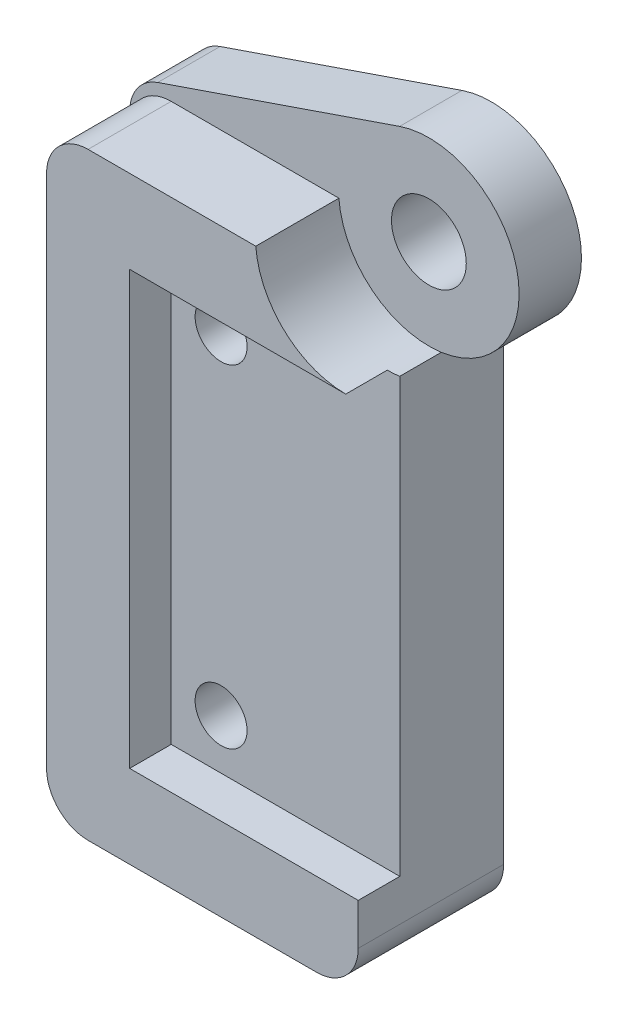
ISO-10303-21;
HEADER;
FILE_DESCRIPTION(('STEP AP214'),'2;1');
FILE_NAME('part.step','',(''),(''),'','','');
FILE_SCHEMA(('AUTOMOTIVE_DESIGN { 1 0 10303 214 1 1 1 1 }'));
ENDSEC;
DATA;
#1=APPLICATION_CONTEXT('core data for automotive mechanical design processes');
#2=APPLICATION_PROTOCOL_DEFINITION('international standard','automotive_design',2000,#1);
#3=PRODUCT_CONTEXT('',#1,'mechanical');
#4=PRODUCT('Part','Part','',(#3));
#5=PRODUCT_RELATED_PRODUCT_CATEGORY('part','',(#4));
#6=PRODUCT_DEFINITION_FORMATION('','',#4);
#7=PRODUCT_DEFINITION_CONTEXT('part definition',#1,'design');
#8=PRODUCT_DEFINITION('design','',#6,#7);
#9=PRODUCT_DEFINITION_SHAPE('','',#8);
#10=(LENGTH_UNIT() NAMED_UNIT(*) SI_UNIT(.MILLI.,.METRE.));
#11=(NAMED_UNIT(*) PLANE_ANGLE_UNIT() SI_UNIT($,.RADIAN.));
#12=(NAMED_UNIT(*) SI_UNIT($,.STERADIAN.) SOLID_ANGLE_UNIT());
#13=UNCERTAINTY_MEASURE_WITH_UNIT(LENGTH_MEASURE(1.E-05),#10,'distance_accuracy_value','');
#14=(GEOMETRIC_REPRESENTATION_CONTEXT(3) GLOBAL_UNCERTAINTY_ASSIGNED_CONTEXT((#13)) GLOBAL_UNIT_ASSIGNED_CONTEXT((#10,
#11,#12)) REPRESENTATION_CONTEXT('',''));
#15=CARTESIAN_POINT('',(0.,0.,0.));
#16=DIRECTION('',(0.,0.,1.));
#17=DIRECTION('',(1.,0.,0.));
#18=AXIS2_PLACEMENT_3D('',#15,#16,#17);
#19=CARTESIAN_POINT('',(0.,0.,3.));
#20=DIRECTION('',(0.,0.,1.));
#21=DIRECTION('',(1.,0.,0.));
#22=AXIS2_PLACEMENT_3D('',#19,#20,#21);
#23=PLANE('',#22);
#24=CARTESIAN_POINT('',(-30.,14.7437,3.));
#25=DIRECTION('',(0.,0.,1.));
#26=DIRECTION('',(1.,0.,0.));
#27=AXIS2_PLACEMENT_3D('',#24,#25,#26);
#28=CIRCLE('',#27,1.8);
#29=CARTESIAN_POINT('',(-28.2,14.7437,3.));
#30=VERTEX_POINT('',#29);
#31=EDGE_CURVE('E259',#30,#30,#28,.T.);
#32=ORIENTED_EDGE('',*,*,#31,.F.);
#33=EDGE_LOOP('',(#32));
#34=FACE_BOUND('',#33,.T.);
#35=DIRECTION('',(0.945980151781312,0.324224540150504,0.));
#36=VECTOR('',#35,1.);
#37=CARTESIAN_POINT('',(-9.08402063587007,26.5041727437287,3.));
#38=LINE('',#37,#36);
#39=CARTESIAN_POINT('',(-43.048449080301,14.8632295662908,3.));
#40=VERTEX_POINT('',#39);
#41=CARTESIAN_POINT('',(-31.4083341350517,18.8527539852925,3.));
#42=VERTEX_POINT('',#41);
#43=EDGE_CURVE('E256',#40,#42,#38,.T.);
#44=ORIENTED_EDGE('',*,*,#43,.F.);
#45=CARTESIAN_POINT('',(-42.4,12.9712692627282,3.));
#46=DIRECTION('',(0.,0.,1.));
#47=DIRECTION('',(1.,0.,0.));
#48=AXIS2_PLACEMENT_3D('',#45,#46,#47);
#49=CIRCLE('',#48,2.);
#50=CARTESIAN_POINT('',(-44.4,12.9712692627282,3.));
#51=VERTEX_POINT('',#50);
#52=EDGE_CURVE('E12',#40,#51,#49,.T.);
#53=ORIENTED_EDGE('',*,*,#52,.T.);
#54=DIRECTION('',(0.,1.,0.));
#55=VECTOR('',#54,1.);
#56=CARTESIAN_POINT('',(-44.4,0.,3.));
#57=LINE('',#56,#55);
#58=CARTESIAN_POINT('',(-44.4,12.4,3.));
#59=VERTEX_POINT('',#58);
#60=EDGE_CURVE('E289',#59,#51,#57,.T.);
#61=ORIENTED_EDGE('',*,*,#60,.F.);
#62=CARTESIAN_POINT('',(-42.4,12.4,3.));
#63=DIRECTION('',(0.,0.,1.));
#64=DIRECTION('',(1.,0.,0.));
#65=AXIS2_PLACEMENT_3D('',#62,#63,#64);
#66=CIRCLE('',#65,2.);
#67=CARTESIAN_POINT('',(-42.4,14.4,3.));
#68=VERTEX_POINT('',#67);
#69=EDGE_CURVE('E315',#59,#68,#66,.F.);
#70=ORIENTED_EDGE('',*,*,#69,.T.);
#71=DIRECTION('',(-1.,0.,0.));
#72=VECTOR('',#71,1.);
#73=CARTESIAN_POINT('',(0.,14.4,3.));
#74=LINE('',#73,#72);
#75=CARTESIAN_POINT('',(-34.3300808306543,14.4,3.));
#76=VERTEX_POINT('',#75);
#77=EDGE_CURVE('E235',#76,#68,#74,.T.);
#78=ORIENTED_EDGE('',*,*,#77,.F.);
#79=CARTESIAN_POINT('',(-30.,14.7437,3.));
#80=DIRECTION('',(0.,0.,1.));
#81=DIRECTION('',(1.,0.,0.));
#82=AXIS2_PLACEMENT_3D('',#79,#80,#81);
#83=CIRCLE('',#82,4.34370000000001);
#84=CARTESIAN_POINT('',(-29.4,10.4416389021075,3.));
#85=VERTEX_POINT('',#84);
#86=EDGE_CURVE('E228',#76,#85,#83,.T.);
#87=ORIENTED_EDGE('',*,*,#86,.T.);
#88=CARTESIAN_POINT('',(-30.,14.7437,3.));
#89=DIRECTION('',(0.,0.,1.));
#90=DIRECTION('',(1.,0.,0.));
#91=AXIS2_PLACEMENT_3D('',#88,#89,#90);
#92=CIRCLE('',#91,4.34370000000001);
#93=EDGE_CURVE('E253',#85,#42,#92,.T.);
#94=ORIENTED_EDGE('',*,*,#93,.T.);
#95=EDGE_LOOP('',(#44,#53,#61,#70,#78,#87,#94));
#96=FACE_BOUND('',#95,.T.);
#97=ADVANCED_FACE('F79',(#34,#96),#23,.T.);
#98=CARTESIAN_POINT('',(-29.4,0.,3.));
#99=DIRECTION('',(1.,0.,0.));
#100=DIRECTION('',(0.,1.,0.));
#101=AXIS2_PLACEMENT_3D('',#98,#99,#100);
#102=PLANE('',#101);
#103=DIRECTION('',(0.,1.,0.));
#104=VECTOR('',#103,1.);
#105=CARTESIAN_POINT('',(-29.4,14.7437,7.));
#106=LINE('',#105,#104);
#107=CARTESIAN_POINT('',(-29.4,-12.4,7.));
#108=VERTEX_POINT('',#107);
#109=CARTESIAN_POINT('',(-29.4,-10.4,7.));
#110=VERTEX_POINT('',#109);
#111=EDGE_CURVE('E205',#108,#110,#106,.T.);
#112=ORIENTED_EDGE('',*,*,#111,.F.);
#113=DIRECTION('',(0.,0.,-1.));
#114=VECTOR('',#113,1.);
#115=CARTESIAN_POINT('',(-29.4,-12.4,3.));
#116=LINE('',#115,#114);
#117=CARTESIAN_POINT('',(-29.4,-12.4,0.));
#118=VERTEX_POINT('',#117);
#119=EDGE_CURVE('E303',#108,#118,#116,.T.);
#120=ORIENTED_EDGE('',*,*,#119,.T.);
#121=DIRECTION('',(0.,-1.,0.));
#122=VECTOR('',#121,1.);
#123=CARTESIAN_POINT('',(-29.4,0.,0.));
#124=LINE('',#123,#122);
#125=CARTESIAN_POINT('',(-29.4,10.4416389021075,0.));
#126=VERTEX_POINT('',#125);
#127=EDGE_CURVE('E268',#126,#118,#124,.T.);
#128=ORIENTED_EDGE('',*,*,#127,.F.);
#129=DIRECTION('',(0.,0.,-1.));
#130=VECTOR('',#129,1.);
#131=CARTESIAN_POINT('',(-29.4,10.4416389021075,3.));
#132=LINE('',#131,#130);
#133=EDGE_CURVE('E285',#85,#126,#132,.T.);
#134=ORIENTED_EDGE('',*,*,#133,.F.);
#135=DIRECTION('',(0.,0.,-1.));
#136=VECTOR('',#135,1.);
#137=CARTESIAN_POINT('',(-29.4,10.4416389021075,5.));
#138=LINE('',#137,#136);
#139=CARTESIAN_POINT('',(-29.4,10.4416389021075,5.));
#140=VERTEX_POINT('',#139);
#141=EDGE_CURVE('E237',#140,#85,#138,.T.);
#142=ORIENTED_EDGE('',*,*,#141,.F.);
#143=DIRECTION('',(0.,1.,0.));
#144=VECTOR('',#143,1.);
#145=CARTESIAN_POINT('',(-29.4,0.,5.));
#146=LINE('',#145,#144);
#147=CARTESIAN_POINT('',(-29.4,-10.4,5.));
#148=VERTEX_POINT('',#147);
#149=EDGE_CURVE('E234',#148,#140,#146,.T.);
#150=ORIENTED_EDGE('',*,*,#149,.F.);
#151=DIRECTION('',(0.,0.,-1.));
#152=VECTOR('',#151,1.);
#153=CARTESIAN_POINT('',(-29.4,-10.4,7.));
#154=LINE('',#153,#152);
#155=EDGE_CURVE('E344',#110,#148,#154,.T.);
#156=ORIENTED_EDGE('',*,*,#155,.F.);
#157=EDGE_LOOP('',(#112,#120,#128,#134,#142,#150,#156));
#158=FACE_BOUND('',#157,.T.);
#159=ADVANCED_FACE('F372',(#158),#102,.T.);
#160=CARTESIAN_POINT('',(-30.,14.7437,3.));
#161=DIRECTION('',(0.,0.,-1.));
#162=DIRECTION('',(-1.,0.,0.));
#163=AXIS2_PLACEMENT_3D('',#160,#161,#162);
#164=CYLINDRICAL_SURFACE('',#163,4.34370000000001);
#165=CARTESIAN_POINT('',(-30.,14.7437,0.));
#166=DIRECTION('',(0.,0.,1.));
#167=DIRECTION('',(1.,0.,0.));
#168=AXIS2_PLACEMENT_3D('',#165,#166,#167);
#169=CIRCLE('',#168,4.34370000000001);
#170=CARTESIAN_POINT('',(-31.4083341350517,18.8527539852925,0.));
#171=VERTEX_POINT('',#170);
#172=EDGE_CURVE('E271',#126,#171,#169,.T.);
#173=ORIENTED_EDGE('',*,*,#172,.T.);
#174=DIRECTION('',(0.,0.,-1.));
#175=VECTOR('',#174,1.);
#176=CARTESIAN_POINT('',(-31.4083341350517,18.8527539852925,3.));
#177=LINE('',#176,#175);
#178=EDGE_CURVE('E262',#42,#171,#177,.T.);
#179=ORIENTED_EDGE('',*,*,#178,.F.);
#180=ORIENTED_EDGE('',*,*,#93,.F.);
#181=ORIENTED_EDGE('',*,*,#133,.T.);
#182=EDGE_LOOP('',(#173,#179,#180,#181));
#183=FACE_BOUND('',#182,.T.);
#184=ADVANCED_FACE('F402',(#183),#164,.T.);
#185=CARTESIAN_POINT('',(-9.08402063587007,26.5041727437287,3.));
#186=DIRECTION('',(-0.324224540150504,0.945980151781312,0.));
#187=DIRECTION('',(-0.945980151781312,-0.324224540150504,0.));
#188=AXIS2_PLACEMENT_3D('',#185,#186,#187);
#189=PLANE('',#188);
#190=DIRECTION('',(0.945980151781312,0.324224540150504,0.));
#191=VECTOR('',#190,1.);
#192=CARTESIAN_POINT('',(-9.08402063587007,26.5041727437287,0.));
#193=LINE('',#192,#191);
#194=CARTESIAN_POINT('',(-43.048449080301,14.8632295662908,0.));
#195=VERTEX_POINT('',#194);
#196=EDGE_CURVE('E274',#195,#171,#193,.T.);
#197=ORIENTED_EDGE('',*,*,#196,.F.);
#198=DIRECTION('',(0.,0.,-1.));
#199=VECTOR('',#198,1.);
#200=CARTESIAN_POINT('',(-43.048449080301,14.8632295662908,3.));
#201=LINE('',#200,#199);
#202=EDGE_CURVE('E87',#195,#40,#201,.F.);
#203=ORIENTED_EDGE('',*,*,#202,.T.);
#204=ORIENTED_EDGE('',*,*,#43,.T.);
#205=ORIENTED_EDGE('',*,*,#178,.T.);
#206=EDGE_LOOP('',(#197,#203,#204,#205));
#207=FACE_BOUND('',#206,.T.);
#208=ADVANCED_FACE('F421',(#207),#189,.T.);
#209=CARTESIAN_POINT('',(-44.4,0.,3.));
#210=DIRECTION('',(-1.,0.,0.));
#211=DIRECTION('',(0.,0.,1.));
#212=AXIS2_PLACEMENT_3D('',#209,#210,#211);
#213=PLANE('',#212);
#214=ORIENTED_EDGE('',*,*,#60,.T.);
#215=DIRECTION('',(0.,0.,-1.));
#216=VECTOR('',#215,1.);
#217=CARTESIAN_POINT('',(-44.4,12.9712692627282,3.));
#218=LINE('',#217,#216);
#219=CARTESIAN_POINT('',(-44.4,12.9712692627282,0.));
#220=VERTEX_POINT('',#219);
#221=EDGE_CURVE('E317',#51,#220,#218,.T.);
#222=ORIENTED_EDGE('',*,*,#221,.T.);
#223=DIRECTION('',(0.,1.,0.));
#224=VECTOR('',#223,1.);
#225=CARTESIAN_POINT('',(-44.4,0.,0.));
#226=LINE('',#225,#224);
#227=CARTESIAN_POINT('',(-44.4,-12.4,0.));
#228=VERTEX_POINT('',#227);
#229=EDGE_CURVE('E276',#228,#220,#226,.T.);
#230=ORIENTED_EDGE('',*,*,#229,.F.);
#231=DIRECTION('',(0.,0.,-1.));
#232=VECTOR('',#231,1.);
#233=CARTESIAN_POINT('',(-44.4,-12.4,3.));
#234=LINE('',#233,#232);
#235=CARTESIAN_POINT('',(-44.4,-12.4,7.));
#236=VERTEX_POINT('',#235);
#237=EDGE_CURVE('E287',#228,#236,#234,.F.);
#238=ORIENTED_EDGE('',*,*,#237,.T.);
#239=DIRECTION('',(0.,-1.,0.));
#240=VECTOR('',#239,1.);
#241=CARTESIAN_POINT('',(-44.4,14.7437,7.));
#242=LINE('',#241,#240);
#243=CARTESIAN_POINT('',(-44.4,12.4,7.));
#244=VERTEX_POINT('',#243);
#245=EDGE_CURVE('E342',#244,#236,#242,.T.);
#246=ORIENTED_EDGE('',*,*,#245,.F.);
#247=DIRECTION('',(0.,0.,-1.));
#248=VECTOR('',#247,1.);
#249=CARTESIAN_POINT('',(-44.4,12.4,3.));
#250=LINE('',#249,#248);
#251=EDGE_CURVE('E292',#244,#59,#250,.T.);
#252=ORIENTED_EDGE('',*,*,#251,.T.);
#253=EDGE_LOOP('',(#214,#222,#230,#238,#246,#252));
#254=FACE_BOUND('',#253,.T.);
#255=ADVANCED_FACE('F323',(#254),#213,.T.);
#256=CARTESIAN_POINT('',(0.,-14.4,3.));
#257=DIRECTION('',(0.,-1.,0.));
#258=DIRECTION('',(1.,0.,0.));
#259=AXIS2_PLACEMENT_3D('',#256,#257,#258);
#260=PLANE('',#259);
#261=DIRECTION('',(-1.,0.,0.));
#262=VECTOR('',#261,1.);
#263=CARTESIAN_POINT('',(0.,-14.4,0.));
#264=LINE('',#263,#262);
#265=CARTESIAN_POINT('',(-31.4,-14.4,0.));
#266=VERTEX_POINT('',#265);
#267=CARTESIAN_POINT('',(-42.4,-14.4,0.));
#268=VERTEX_POINT('',#267);
#269=EDGE_CURVE('E278',#266,#268,#264,.T.);
#270=ORIENTED_EDGE('',*,*,#269,.F.);
#271=DIRECTION('',(0.,0.,-1.));
#272=VECTOR('',#271,1.);
#273=CARTESIAN_POINT('',(-31.4,-14.4,3.));
#274=LINE('',#273,#272);
#275=CARTESIAN_POINT('',(-31.4,-14.4,7.));
#276=VERTEX_POINT('',#275);
#277=EDGE_CURVE('E313',#266,#276,#274,.F.);
#278=ORIENTED_EDGE('',*,*,#277,.T.);
#279=DIRECTION('',(1.,0.,0.));
#280=VECTOR('',#279,1.);
#281=CARTESIAN_POINT('',(-30.,-14.4,7.));
#282=LINE('',#281,#280);
#283=CARTESIAN_POINT('',(-42.4,-14.4,7.));
#284=VERTEX_POINT('',#283);
#285=EDGE_CURVE('E340',#284,#276,#282,.T.);
#286=ORIENTED_EDGE('',*,*,#285,.F.);
#287=DIRECTION('',(0.,0.,-1.));
#288=VECTOR('',#287,1.);
#289=CARTESIAN_POINT('',(-42.4,-14.4,3.));
#290=LINE('',#289,#288);
#291=EDGE_CURVE('E310',#284,#268,#290,.T.);
#292=ORIENTED_EDGE('',*,*,#291,.T.);
#293=EDGE_LOOP('',(#270,#278,#286,#292));
#294=FACE_BOUND('',#293,.T.);
#295=ADVANCED_FACE('F337',(#294),#260,.T.);
#296=CARTESIAN_POINT('',(-38.,-8.,3.));
#297=DIRECTION('',(0.,0.,-1.));
#298=DIRECTION('',(-1.,0.,0.));
#299=AXIS2_PLACEMENT_3D('',#296,#297,#298);
#300=CYLINDRICAL_SURFACE('',#299,2.30000000000001);
#301=CARTESIAN_POINT('',(-38.,-8.,3.));
#302=DIRECTION('',(0.,0.,1.));
#303=DIRECTION('',(1.,0.,0.));
#304=AXIS2_PLACEMENT_3D('',#301,#302,#303);
#305=CIRCLE('',#304,2.30000000000001);
#306=CARTESIAN_POINT('',(-35.7,-8.,3.));
#307=VERTEX_POINT('',#306);
#308=EDGE_CURVE('E244',#307,#307,#305,.T.);
#309=ORIENTED_EDGE('',*,*,#308,.T.);
#310=EDGE_LOOP('',(#309));
#311=FACE_BOUND('',#310,.T.);
#312=CARTESIAN_POINT('',(-38.,-8.,0.));
#313=DIRECTION('',(0.,0.,1.));
#314=DIRECTION('',(1.,0.,0.));
#315=AXIS2_PLACEMENT_3D('',#312,#313,#314);
#316=CIRCLE('',#315,2.30000000000001);
#317=CARTESIAN_POINT('',(-35.7,-8.,0.));
#318=VERTEX_POINT('',#317);
#319=EDGE_CURVE('E265',#318,#318,#316,.T.);
#320=ORIENTED_EDGE('',*,*,#319,.F.);
#321=EDGE_LOOP('',(#320));
#322=FACE_BOUND('',#321,.T.);
#323=ADVANCED_FACE('F418',(#311,#322),#300,.F.);
#324=CARTESIAN_POINT('',(-38.,8.,3.));
#325=DIRECTION('',(0.,0.,-1.));
#326=DIRECTION('',(-1.,0.,0.));
#327=AXIS2_PLACEMENT_3D('',#324,#325,#326);
#328=CYLINDRICAL_SURFACE('',#327,2.30000000000001);
#329=CARTESIAN_POINT('',(-38.,8.,3.));
#330=DIRECTION('',(0.,0.,1.));
#331=DIRECTION('',(1.,0.,0.));
#332=AXIS2_PLACEMENT_3D('',#329,#330,#331);
#333=CIRCLE('',#332,2.30000000000001);
#334=CARTESIAN_POINT('',(-35.7,8.,3.));
#335=VERTEX_POINT('',#334);
#336=EDGE_CURVE('E247',#335,#335,#333,.T.);
#337=ORIENTED_EDGE('',*,*,#336,.T.);
#338=EDGE_LOOP('',(#337));
#339=FACE_BOUND('',#338,.T.);
#340=CARTESIAN_POINT('',(-38.,8.,0.));
#341=DIRECTION('',(0.,0.,1.));
#342=DIRECTION('',(1.,0.,0.));
#343=AXIS2_PLACEMENT_3D('',#340,#341,#342);
#344=CIRCLE('',#343,2.30000000000001);
#345=CARTESIAN_POINT('',(-35.7,8.,0.));
#346=VERTEX_POINT('',#345);
#347=EDGE_CURVE('E250',#346,#346,#344,.T.);
#348=ORIENTED_EDGE('',*,*,#347,.F.);
#349=EDGE_LOOP('',(#348));
#350=FACE_BOUND('',#349,.T.);
#351=ADVANCED_FACE('F414',(#339,#350),#328,.F.);
#352=CARTESIAN_POINT('',(-30.,14.7437,3.));
#353=DIRECTION('',(0.,0.,-1.));
#354=DIRECTION('',(-1.,0.,0.));
#355=AXIS2_PLACEMENT_3D('',#352,#353,#354);
#356=CYLINDRICAL_SURFACE('',#355,1.8);
#357=ORIENTED_EDGE('',*,*,#31,.T.);
#358=EDGE_LOOP('',(#357));
#359=FACE_BOUND('',#358,.T.);
#360=CARTESIAN_POINT('',(-30.,14.7437,0.));
#361=DIRECTION('',(0.,0.,1.));
#362=DIRECTION('',(1.,0.,0.));
#363=AXIS2_PLACEMENT_3D('',#360,#361,#362);
#364=CIRCLE('',#363,1.8);
#365=CARTESIAN_POINT('',(-28.2,14.7437,0.));
#366=VERTEX_POINT('',#365);
#367=EDGE_CURVE('E257',#366,#366,#364,.T.);
#368=ORIENTED_EDGE('',*,*,#367,.F.);
#369=EDGE_LOOP('',(#368));
#370=FACE_BOUND('',#369,.T.);
#371=ADVANCED_FACE('F410',(#359,#370),#356,.F.);
#372=CARTESIAN_POINT('',(0.,0.,0.));
#373=DIRECTION('',(0.,0.,1.));
#374=DIRECTION('',(1.,0.,0.));
#375=AXIS2_PLACEMENT_3D('',#372,#373,#374);
#376=PLANE('',#375);
#377=ORIENTED_EDGE('',*,*,#347,.T.);
#378=EDGE_LOOP('',(#377));
#379=FACE_BOUND('',#378,.T.);
#380=ORIENTED_EDGE('',*,*,#319,.T.);
#381=EDGE_LOOP('',(#380));
#382=FACE_BOUND('',#381,.T.);
#383=ORIENTED_EDGE('',*,*,#229,.T.);
#384=CARTESIAN_POINT('',(-42.4,12.9712692627282,0.));
#385=DIRECTION('',(0.,0.,1.));
#386=DIRECTION('',(1.,0.,0.));
#387=AXIS2_PLACEMENT_3D('',#384,#385,#386);
#388=CIRCLE('',#387,2.);
#389=EDGE_CURVE('E101',#220,#195,#388,.F.);
#390=ORIENTED_EDGE('',*,*,#389,.T.);
#391=ORIENTED_EDGE('',*,*,#196,.T.);
#392=ORIENTED_EDGE('',*,*,#172,.F.);
#393=ORIENTED_EDGE('',*,*,#127,.T.);
#394=CARTESIAN_POINT('',(-31.4,-12.4,0.));
#395=DIRECTION('',(0.,0.,1.));
#396=DIRECTION('',(1.,0.,0.));
#397=AXIS2_PLACEMENT_3D('',#394,#395,#396);
#398=CIRCLE('',#397,2.);
#399=EDGE_CURVE('E308',#118,#266,#398,.F.);
#400=ORIENTED_EDGE('',*,*,#399,.T.);
#401=ORIENTED_EDGE('',*,*,#269,.T.);
#402=CARTESIAN_POINT('',(-42.4,-12.4,0.));
#403=DIRECTION('',(0.,0.,1.));
#404=DIRECTION('',(1.,0.,0.));
#405=AXIS2_PLACEMENT_3D('',#402,#403,#404);
#406=CIRCLE('',#405,2.);
#407=EDGE_CURVE('E306',#268,#228,#406,.F.);
#408=ORIENTED_EDGE('',*,*,#407,.T.);
#409=EDGE_LOOP('',(#383,#390,#391,#392,#393,#400,#401,#408));
#410=FACE_BOUND('',#409,.T.);
#411=ORIENTED_EDGE('',*,*,#367,.T.);
#412=EDGE_LOOP('',(#411));
#413=FACE_BOUND('',#412,.T.);
#414=ADVANCED_FACE('F328',(#379,#382,#410,#413),#376,.F.);
#415=CARTESIAN_POINT('',(-30.,14.7437,3.));
#416=DIRECTION('',(0.,0.,1.));
#417=DIRECTION('',(1.,0.,0.));
#418=AXIS2_PLACEMENT_3D('',#415,#416,#417);
#419=PLANE('',#418);
#420=ORIENTED_EDGE('',*,*,#336,.F.);
#421=EDGE_LOOP('',(#420));
#422=FACE_BOUND('',#421,.T.);
#423=CARTESIAN_POINT('',(-38.,8.,3.));
#424=DIRECTION('',(0.,0.,1.));
#425=DIRECTION('',(1.,0.,0.));
#426=AXIS2_PLACEMENT_3D('',#423,#424,#425);
#427=CIRCLE('',#426,1.25);
#428=CARTESIAN_POINT('',(-36.75,8.,3.));
#429=VERTEX_POINT('',#428);
#430=EDGE_CURVE('E213',#429,#429,#427,.T.);
#431=ORIENTED_EDGE('',*,*,#430,.T.);
#432=EDGE_LOOP('',(#431));
#433=FACE_BOUND('',#432,.T.);
#434=ADVANCED_FACE('F409',(#422,#433),#419,.F.);
#435=CARTESIAN_POINT('',(-30.,14.7437,5.));
#436=DIRECTION('',(0.,0.,1.));
#437=DIRECTION('',(1.,0.,0.));
#438=AXIS2_PLACEMENT_3D('',#435,#436,#437);
#439=PLANE('',#438);
#440=DIRECTION('',(-1.,0.,0.));
#441=VECTOR('',#440,1.);
#442=CARTESIAN_POINT('',(-30.,-10.4,5.));
#443=LINE('',#442,#441);
#444=CARTESIAN_POINT('',(-40.4,-10.4,5.));
#445=VERTEX_POINT('',#444);
#446=EDGE_CURVE('E212',#148,#445,#443,.T.);
#447=ORIENTED_EDGE('',*,*,#446,.F.);
#448=ORIENTED_EDGE('',*,*,#149,.T.);
#449=CARTESIAN_POINT('',(-30.,14.7437,5.));
#450=DIRECTION('',(0.,0.,1.));
#451=DIRECTION('',(1.,0.,0.));
#452=AXIS2_PLACEMENT_3D('',#449,#450,#451);
#453=CIRCLE('',#452,4.34370000000001);
#454=CARTESIAN_POINT('',(-30.,10.4,5.));
#455=VERTEX_POINT('',#454);
#456=EDGE_CURVE('E231',#455,#140,#453,.T.);
#457=ORIENTED_EDGE('',*,*,#456,.F.);
#458=DIRECTION('',(1.,0.,0.));
#459=VECTOR('',#458,1.);
#460=CARTESIAN_POINT('',(-30.,10.4,5.));
#461=LINE('',#460,#459);
#462=CARTESIAN_POINT('',(-40.4,10.4,5.));
#463=VERTEX_POINT('',#462);
#464=EDGE_CURVE('E209',#463,#455,#461,.T.);
#465=ORIENTED_EDGE('',*,*,#464,.F.);
#466=DIRECTION('',(0.,1.,0.));
#467=VECTOR('',#466,1.);
#468=CARTESIAN_POINT('',(-40.4,14.7437,5.));
#469=LINE('',#468,#467);
#470=EDGE_CURVE('E352',#445,#463,#469,.T.);
#471=ORIENTED_EDGE('',*,*,#470,.F.);
#472=EDGE_LOOP('',(#447,#448,#457,#465,#471));
#473=FACE_BOUND('',#472,.T.);
#474=CARTESIAN_POINT('',(-38.,-8.,5.));
#475=DIRECTION('',(0.,0.,1.));
#476=DIRECTION('',(1.,0.,0.));
#477=AXIS2_PLACEMENT_3D('',#474,#475,#476);
#478=CIRCLE('',#477,1.25);
#479=CARTESIAN_POINT('',(-36.75,-8.,5.));
#480=VERTEX_POINT('',#479);
#481=EDGE_CURVE('E225',#480,#480,#478,.T.);
#482=ORIENTED_EDGE('',*,*,#481,.F.);
#483=EDGE_LOOP('',(#482));
#484=FACE_BOUND('',#483,.T.);
#485=CARTESIAN_POINT('',(-38.,8.,5.));
#486=DIRECTION('',(0.,0.,1.));
#487=DIRECTION('',(1.,0.,0.));
#488=AXIS2_PLACEMENT_3D('',#485,#486,#487);
#489=CIRCLE('',#488,1.25);
#490=CARTESIAN_POINT('',(-36.75,8.,5.));
#491=VERTEX_POINT('',#490);
#492=EDGE_CURVE('E216',#491,#491,#489,.T.);
#493=ORIENTED_EDGE('',*,*,#492,.F.);
#494=EDGE_LOOP('',(#493));
#495=FACE_BOUND('',#494,.T.);
#496=ADVANCED_FACE('F368',(#473,#484,#495),#439,.T.);
#497=ORIENTED_EDGE('',*,*,#308,.F.);
#498=EDGE_LOOP('',(#497));
#499=FACE_BOUND('',#498,.T.);
#500=CARTESIAN_POINT('',(-38.,-8.,3.));
#501=DIRECTION('',(0.,0.,1.));
#502=DIRECTION('',(1.,0.,0.));
#503=AXIS2_PLACEMENT_3D('',#500,#501,#502);
#504=CIRCLE('',#503,1.25);
#505=CARTESIAN_POINT('',(-36.75,-8.,3.));
#506=VERTEX_POINT('',#505);
#507=EDGE_CURVE('E223',#506,#506,#504,.T.);
#508=ORIENTED_EDGE('',*,*,#507,.T.);
#509=EDGE_LOOP('',(#508));
#510=FACE_BOUND('',#509,.T.);
#511=ADVANCED_FACE('F519',(#499,#510),#419,.F.);
#512=CARTESIAN_POINT('',(-30.,14.7437,5.));
#513=DIRECTION('',(0.,0.,-1.));
#514=DIRECTION('',(-1.,0.,0.));
#515=AXIS2_PLACEMENT_3D('',#512,#513,#514);
#516=CYLINDRICAL_SURFACE('',#515,4.34370000000001);
#517=ORIENTED_EDGE('',*,*,#86,.F.);
#518=DIRECTION('',(0.,0.,-1.));
#519=VECTOR('',#518,1.);
#520=CARTESIAN_POINT('',(-34.3300808306543,14.4,5.));
#521=LINE('',#520,#519);
#522=CARTESIAN_POINT('',(-34.3300808306543,14.4,7.));
#523=VERTEX_POINT('',#522);
#524=EDGE_CURVE('E241',#523,#76,#521,.T.);
#525=ORIENTED_EDGE('',*,*,#524,.F.);
#526=CARTESIAN_POINT('',(-30.,14.7437,7.));
#527=DIRECTION('',(0.,0.,1.));
#528=DIRECTION('',(1.,0.,0.));
#529=AXIS2_PLACEMENT_3D('',#526,#527,#528);
#530=CIRCLE('',#529,4.34370000000001);
#531=CARTESIAN_POINT('',(-30.,10.4,7.));
#532=VERTEX_POINT('',#531);
#533=EDGE_CURVE('E364',#523,#532,#530,.T.);
#534=ORIENTED_EDGE('',*,*,#533,.T.);
#535=DIRECTION('',(0.,0.,-1.));
#536=VECTOR('',#535,1.);
#537=CARTESIAN_POINT('',(-30.,10.4,7.));
#538=LINE('',#537,#536);
#539=EDGE_CURVE('E218',#532,#455,#538,.T.);
#540=ORIENTED_EDGE('',*,*,#539,.T.);
#541=ORIENTED_EDGE('',*,*,#456,.T.);
#542=ORIENTED_EDGE('',*,*,#141,.T.);
#543=EDGE_LOOP('',(#517,#525,#534,#540,#541,#542));
#544=FACE_BOUND('',#543,.T.);
#545=ADVANCED_FACE('F361',(#544),#516,.F.);
#546=CARTESIAN_POINT('',(0.,14.4,5.));
#547=DIRECTION('',(0.,-1.,0.));
#548=DIRECTION('',(1.,0.,0.));
#549=AXIS2_PLACEMENT_3D('',#546,#547,#548);
#550=PLANE('',#549);
#551=ORIENTED_EDGE('',*,*,#77,.T.);
#552=DIRECTION('',(0.,0.,-1.));
#553=VECTOR('',#552,1.);
#554=CARTESIAN_POINT('',(-42.4,14.4,7.));
#555=LINE('',#554,#553);
#556=CARTESIAN_POINT('',(-42.4,14.4,7.));
#557=VERTEX_POINT('',#556);
#558=EDGE_CURVE('E295',#68,#557,#555,.F.);
#559=ORIENTED_EDGE('',*,*,#558,.T.);
#560=DIRECTION('',(-1.,0.,0.));
#561=VECTOR('',#560,1.);
#562=CARTESIAN_POINT('',(-30.,14.4,7.));
#563=LINE('',#562,#561);
#564=EDGE_CURVE('E347',#523,#557,#563,.T.);
#565=ORIENTED_EDGE('',*,*,#564,.F.);
#566=ORIENTED_EDGE('',*,*,#524,.T.);
#567=EDGE_LOOP('',(#551,#559,#565,#566));
#568=FACE_BOUND('',#567,.T.);
#569=ADVANCED_FACE('F381',(#568),#550,.F.);
#570=CARTESIAN_POINT('',(-38.,-8.,5.));
#571=DIRECTION('',(0.,0.,-1.));
#572=DIRECTION('',(-1.,0.,0.));
#573=AXIS2_PLACEMENT_3D('',#570,#571,#572);
#574=CYLINDRICAL_SURFACE('',#573,1.25);
#575=ORIENTED_EDGE('',*,*,#481,.T.);
#576=EDGE_LOOP('',(#575));
#577=FACE_BOUND('',#576,.T.);
#578=ORIENTED_EDGE('',*,*,#507,.F.);
#579=EDGE_LOOP('',(#578));
#580=FACE_BOUND('',#579,.T.);
#581=ADVANCED_FACE('F495',(#577,#580),#574,.F.);
#582=CARTESIAN_POINT('',(-38.,8.,5.));
#583=DIRECTION('',(0.,0.,-1.));
#584=DIRECTION('',(-1.,0.,0.));
#585=AXIS2_PLACEMENT_3D('',#582,#583,#584);
#586=CYLINDRICAL_SURFACE('',#585,1.25);
#587=ORIENTED_EDGE('',*,*,#492,.T.);
#588=EDGE_LOOP('',(#587));
#589=FACE_BOUND('',#588,.T.);
#590=ORIENTED_EDGE('',*,*,#430,.F.);
#591=EDGE_LOOP('',(#590));
#592=FACE_BOUND('',#591,.T.);
#593=ADVANCED_FACE('F486',(#589,#592),#586,.F.);
#594=CARTESIAN_POINT('',(-30.,-10.4,7.));
#595=DIRECTION('',(0.,-1.,0.));
#596=DIRECTION('',(1.,0.,0.));
#597=AXIS2_PLACEMENT_3D('',#594,#595,#596);
#598=PLANE('',#597);
#599=ORIENTED_EDGE('',*,*,#446,.T.);
#600=DIRECTION('',(0.,0.,-1.));
#601=VECTOR('',#600,1.);
#602=CARTESIAN_POINT('',(-40.4,-10.4,7.));
#603=LINE('',#602,#601);
#604=CARTESIAN_POINT('',(-40.4,-10.4,7.));
#605=VERTEX_POINT('',#604);
#606=EDGE_CURVE('E192',#605,#445,#603,.T.);
#607=ORIENTED_EDGE('',*,*,#606,.F.);
#608=DIRECTION('',(-1.,0.,0.));
#609=VECTOR('',#608,1.);
#610=CARTESIAN_POINT('',(-30.,-10.4,7.));
#611=LINE('',#610,#609);
#612=EDGE_CURVE('E199',#110,#605,#611,.T.);
#613=ORIENTED_EDGE('',*,*,#612,.F.);
#614=ORIENTED_EDGE('',*,*,#155,.T.);
#615=EDGE_LOOP('',(#599,#607,#613,#614));
#616=FACE_BOUND('',#615,.T.);
#617=ADVANCED_FACE('F211',(#616),#598,.F.);
#618=CARTESIAN_POINT('',(-40.4,14.7437,7.));
#619=DIRECTION('',(-1.,0.,0.));
#620=DIRECTION('',(0.,0.,1.));
#621=AXIS2_PLACEMENT_3D('',#618,#619,#620);
#622=PLANE('',#621);
#623=ORIENTED_EDGE('',*,*,#470,.T.);
#624=DIRECTION('',(0.,0.,-1.));
#625=VECTOR('',#624,1.);
#626=CARTESIAN_POINT('',(-40.4,10.4,7.));
#627=LINE('',#626,#625);
#628=CARTESIAN_POINT('',(-40.4,10.4,7.));
#629=VERTEX_POINT('',#628);
#630=EDGE_CURVE('E195',#629,#463,#627,.T.);
#631=ORIENTED_EDGE('',*,*,#630,.F.);
#632=DIRECTION('',(0.,1.,0.));
#633=VECTOR('',#632,1.);
#634=CARTESIAN_POINT('',(-40.4,14.7437,7.));
#635=LINE('',#634,#633);
#636=EDGE_CURVE('E187',#605,#629,#635,.T.);
#637=ORIENTED_EDGE('',*,*,#636,.F.);
#638=ORIENTED_EDGE('',*,*,#606,.T.);
#639=EDGE_LOOP('',(#623,#631,#637,#638));
#640=FACE_BOUND('',#639,.T.);
#641=ADVANCED_FACE('F190',(#640),#622,.F.);
#642=CARTESIAN_POINT('',(-30.,10.4,7.));
#643=DIRECTION('',(0.,1.,0.));
#644=DIRECTION('',(-1.,0.,0.));
#645=AXIS2_PLACEMENT_3D('',#642,#643,#644);
#646=PLANE('',#645);
#647=ORIENTED_EDGE('',*,*,#464,.T.);
#648=ORIENTED_EDGE('',*,*,#539,.F.);
#649=DIRECTION('',(1.,0.,0.));
#650=VECTOR('',#649,1.);
#651=CARTESIAN_POINT('',(-30.,10.4,7.));
#652=LINE('',#651,#650);
#653=EDGE_CURVE('E198',#629,#532,#652,.T.);
#654=ORIENTED_EDGE('',*,*,#653,.F.);
#655=ORIENTED_EDGE('',*,*,#630,.T.);
#656=EDGE_LOOP('',(#647,#648,#654,#655));
#657=FACE_BOUND('',#656,.T.);
#658=ADVANCED_FACE('F366',(#657),#646,.F.);
#659=CARTESIAN_POINT('',(-30.,14.7437,7.));
#660=DIRECTION('',(0.,0.,1.));
#661=DIRECTION('',(1.,0.,0.));
#662=AXIS2_PLACEMENT_3D('',#659,#660,#661);
#663=PLANE('',#662);
#664=ORIENTED_EDGE('',*,*,#564,.T.);
#665=CARTESIAN_POINT('',(-42.4,12.4,7.));
#666=DIRECTION('',(0.,0.,1.));
#667=DIRECTION('',(1.,0.,0.));
#668=AXIS2_PLACEMENT_3D('',#665,#666,#667);
#669=CIRCLE('',#668,2.);
#670=EDGE_CURVE('E301',#557,#244,#669,.T.);
#671=ORIENTED_EDGE('',*,*,#670,.T.);
#672=ORIENTED_EDGE('',*,*,#245,.T.);
#673=CARTESIAN_POINT('',(-42.4,-12.4,7.));
#674=DIRECTION('',(0.,0.,1.));
#675=DIRECTION('',(1.,0.,0.));
#676=AXIS2_PLACEMENT_3D('',#673,#674,#675);
#677=CIRCLE('',#676,2.);
#678=EDGE_CURVE('E297',#236,#284,#677,.T.);
#679=ORIENTED_EDGE('',*,*,#678,.T.);
#680=ORIENTED_EDGE('',*,*,#285,.T.);
#681=CARTESIAN_POINT('',(-31.4,-12.4,7.));
#682=DIRECTION('',(0.,0.,1.));
#683=DIRECTION('',(1.,0.,0.));
#684=AXIS2_PLACEMENT_3D('',#681,#682,#683);
#685=CIRCLE('',#684,2.);
#686=EDGE_CURVE('E299',#276,#108,#685,.T.);
#687=ORIENTED_EDGE('',*,*,#686,.T.);
#688=ORIENTED_EDGE('',*,*,#111,.T.);
#689=ORIENTED_EDGE('',*,*,#612,.T.);
#690=ORIENTED_EDGE('',*,*,#636,.T.);
#691=ORIENTED_EDGE('',*,*,#653,.T.);
#692=ORIENTED_EDGE('',*,*,#533,.F.);
#693=EDGE_LOOP('',(#664,#671,#672,#679,#680,#687,#688,#689,#690,#691,#692));
#694=FACE_BOUND('',#693,.T.);
#695=ADVANCED_FACE('F203',(#694),#663,.T.);
#696=CARTESIAN_POINT('',(-42.4,12.4,3.));
#697=DIRECTION('',(0.,0.,1.));
#698=DIRECTION('',(1.,0.,0.));
#699=AXIS2_PLACEMENT_3D('',#696,#697,#698);
#700=CYLINDRICAL_SURFACE('',#699,2.);
#701=ORIENTED_EDGE('',*,*,#670,.F.);
#702=ORIENTED_EDGE('',*,*,#558,.F.);
#703=ORIENTED_EDGE('',*,*,#69,.F.);
#704=ORIENTED_EDGE('',*,*,#251,.F.);
#705=EDGE_LOOP('',(#701,#702,#703,#704));
#706=FACE_BOUND('',#705,.T.);
#707=ADVANCED_FACE('F388',(#706),#700,.T.);
#708=CARTESIAN_POINT('',(-31.4,-12.4,3.));
#709=DIRECTION('',(0.,0.,-1.));
#710=DIRECTION('',(-1.,0.,0.));
#711=AXIS2_PLACEMENT_3D('',#708,#709,#710);
#712=CYLINDRICAL_SURFACE('',#711,2.);
#713=ORIENTED_EDGE('',*,*,#686,.F.);
#714=ORIENTED_EDGE('',*,*,#277,.F.);
#715=ORIENTED_EDGE('',*,*,#399,.F.);
#716=ORIENTED_EDGE('',*,*,#119,.F.);
#717=EDGE_LOOP('',(#713,#714,#715,#716));
#718=FACE_BOUND('',#717,.T.);
#719=ADVANCED_FACE('F394',(#718),#712,.T.);
#720=CARTESIAN_POINT('',(-42.4,-12.4,3.));
#721=DIRECTION('',(0.,0.,-1.));
#722=DIRECTION('',(-1.,0.,0.));
#723=AXIS2_PLACEMENT_3D('',#720,#721,#722);
#724=CYLINDRICAL_SURFACE('',#723,2.);
#725=ORIENTED_EDGE('',*,*,#678,.F.);
#726=ORIENTED_EDGE('',*,*,#237,.F.);
#727=ORIENTED_EDGE('',*,*,#407,.F.);
#728=ORIENTED_EDGE('',*,*,#291,.F.);
#729=EDGE_LOOP('',(#725,#726,#727,#728));
#730=FACE_BOUND('',#729,.T.);
#731=ADVANCED_FACE('F334',(#730),#724,.T.);
#732=CARTESIAN_POINT('',(-42.4,12.9712692627282,3.));
#733=DIRECTION('',(0.,0.,-1.));
#734=DIRECTION('',(-1.,0.,0.));
#735=AXIS2_PLACEMENT_3D('',#732,#733,#734);
#736=CYLINDRICAL_SURFACE('',#735,2.);
#737=ORIENTED_EDGE('',*,*,#52,.F.);
#738=ORIENTED_EDGE('',*,*,#202,.F.);
#739=ORIENTED_EDGE('',*,*,#389,.F.);
#740=ORIENTED_EDGE('',*,*,#221,.F.);
#741=EDGE_LOOP('',(#737,#738,#739,#740));
#742=FACE_BOUND('',#741,.T.);
#743=ADVANCED_FACE('F81',(#742),#736,.T.);
#744=CLOSED_SHELL('',(#97,#159,#184,#208,#255,#295,#323,#351,#371,#414,#434,#496,#511,#545,#569,
#581,#593,#617,#641,#658,#695,#707,#719,#731,#743));
#745=MANIFOLD_SOLID_BREP('B2',#744);
#746=ADVANCED_BREP_SHAPE_REPRESENTATION('',(#18,#745),#14);
#747=SHAPE_DEFINITION_REPRESENTATION(#9,#746);
ENDSEC;
END-ISO-10303-21;
